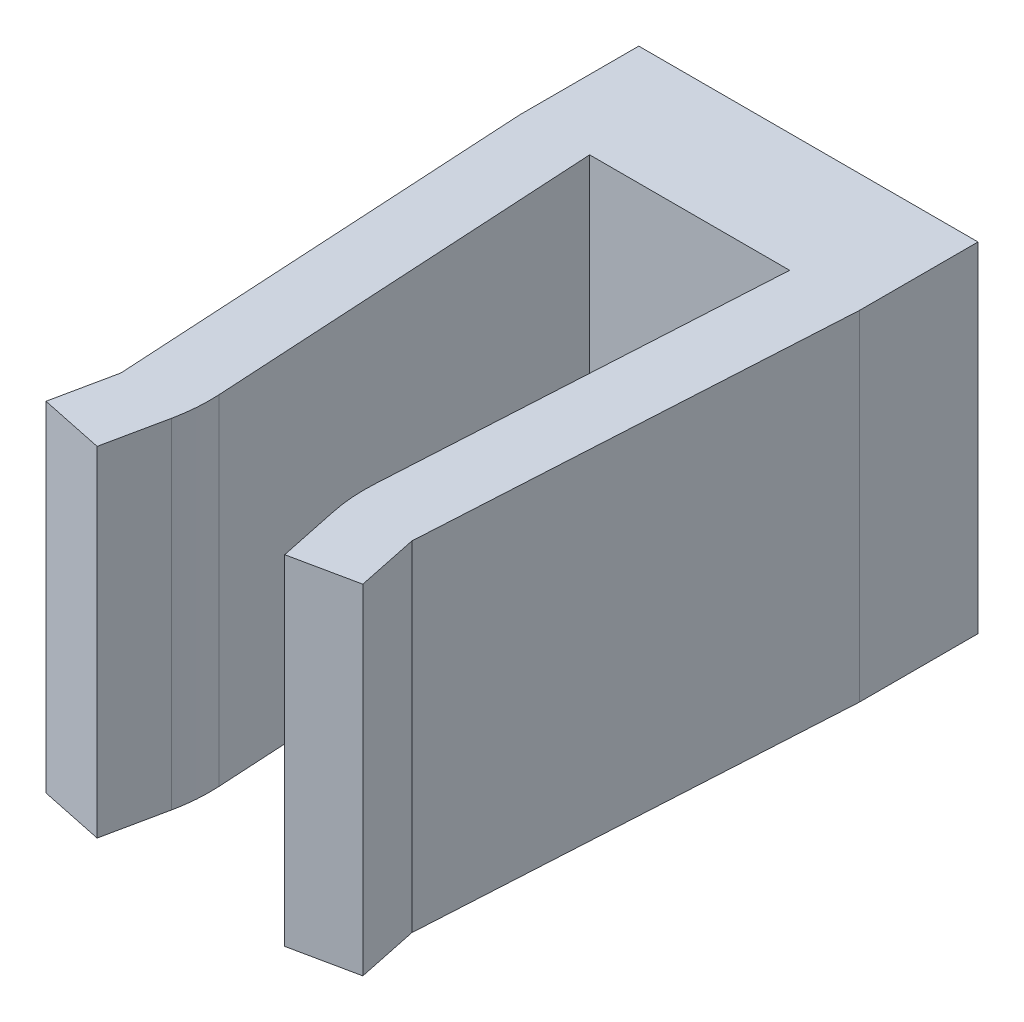
ISO-10303-21;
HEADER;
FILE_DESCRIPTION(('STEP AP214'),'2;1');
FILE_NAME('part.step','',(''),(''),'','','');
FILE_SCHEMA(('AUTOMOTIVE_DESIGN { 1 0 10303 214 1 1 1 1 }'));
ENDSEC;
DATA;
#1=APPLICATION_CONTEXT('core data for automotive mechanical design processes');
#2=APPLICATION_PROTOCOL_DEFINITION('international standard','automotive_design',2000,#1);
#3=PRODUCT_CONTEXT('',#1,'mechanical');
#4=PRODUCT('Part','Part','',(#3));
#5=PRODUCT_RELATED_PRODUCT_CATEGORY('part','',(#4));
#6=PRODUCT_DEFINITION_FORMATION('','',#4);
#7=PRODUCT_DEFINITION_CONTEXT('part definition',#1,'design');
#8=PRODUCT_DEFINITION('design','',#6,#7);
#9=PRODUCT_DEFINITION_SHAPE('','',#8);
#10=(LENGTH_UNIT() NAMED_UNIT(*) SI_UNIT(.MILLI.,.METRE.));
#11=(NAMED_UNIT(*) PLANE_ANGLE_UNIT() SI_UNIT($,.RADIAN.));
#12=(NAMED_UNIT(*) SI_UNIT($,.STERADIAN.) SOLID_ANGLE_UNIT());
#13=UNCERTAINTY_MEASURE_WITH_UNIT(LENGTH_MEASURE(1.E-05),#10,'distance_accuracy_value','');
#14=(GEOMETRIC_REPRESENTATION_CONTEXT(3) GLOBAL_UNCERTAINTY_ASSIGNED_CONTEXT((#13)) GLOBAL_UNIT_ASSIGNED_CONTEXT((#10,
#11,#12)) REPRESENTATION_CONTEXT('',''));
#15=CARTESIAN_POINT('',(0.,0.,0.));
#16=DIRECTION('',(0.,0.,1.));
#17=DIRECTION('',(1.,0.,0.));
#18=AXIS2_PLACEMENT_3D('',#15,#16,#17);
#19=CARTESIAN_POINT('',(0.,0.,7.));
#20=DIRECTION('',(0.,0.,1.));
#21=DIRECTION('',(1.,0.,0.));
#22=AXIS2_PLACEMENT_3D('',#19,#20,#21);
#23=PLANE('',#22);
#24=DIRECTION('',(0.,1.,0.));
#25=VECTOR('',#24,1.);
#26=CARTESIAN_POINT('',(4.10419195222356,-20.,7.));
#27=LINE('',#26,#25);
#28=CARTESIAN_POINT('',(4.10419195222356,-20.,7.));
#29=VERTEX_POINT('',#28);
#30=CARTESIAN_POINT('',(4.10419195222356,0.,7.));
#31=VERTEX_POINT('',#30);
#32=EDGE_CURVE('E198',#29,#31,#27,.T.);
#33=ORIENTED_EDGE('',*,*,#32,.F.);
#34=DIRECTION('',(1.,0.,0.));
#35=VECTOR('',#34,1.);
#36=CARTESIAN_POINT('',(0.,-20.,7.));
#37=LINE('',#36,#35);
#38=CARTESIAN_POINT('',(15.8958080477764,-20.,7.));
#39=VERTEX_POINT('',#38);
#40=EDGE_CURVE('E248',#29,#39,#37,.T.);
#41=ORIENTED_EDGE('',*,*,#40,.T.);
#42=DIRECTION('',(0.,1.,0.));
#43=VECTOR('',#42,1.);
#44=CARTESIAN_POINT('',(15.8958080477764,-20.,7.));
#45=LINE('',#44,#43);
#46=CARTESIAN_POINT('',(15.8958080477764,0.,7.));
#47=VERTEX_POINT('',#46);
#48=EDGE_CURVE('E211',#39,#47,#45,.T.);
#49=ORIENTED_EDGE('',*,*,#48,.T.);
#50=DIRECTION('',(-1.,0.,0.));
#51=VECTOR('',#50,1.);
#52=CARTESIAN_POINT('',(0.,0.,7.));
#53=LINE('',#52,#51);
#54=EDGE_CURVE('E252',#47,#31,#53,.T.);
#55=ORIENTED_EDGE('',*,*,#54,.T.);
#56=EDGE_LOOP('',(#33,#41,#49,#55));
#57=FACE_BOUND('',#56,.T.);
#58=CARTESIAN_POINT('',(10.,-10.,7.));
#59=DIRECTION('',(0.,0.,1.));
#60=DIRECTION('',(1.,0.,0.));
#61=AXIS2_PLACEMENT_3D('',#58,#59,#60);
#62=CIRCLE('',#61,2.75);
#63=CARTESIAN_POINT('',(12.75,-10.,7.));
#64=VERTEX_POINT('',#63);
#65=EDGE_CURVE('E200',#64,#64,#62,.T.);
#66=ORIENTED_EDGE('',*,*,#65,.F.);
#67=EDGE_LOOP('',(#66));
#68=FACE_BOUND('',#67,.T.);
#69=ADVANCED_FACE('F39',(#57,#68),#23,.T.);
#70=CARTESIAN_POINT('',(0.,0.,7.));
#71=DIRECTION('',(1.,0.,0.));
#72=DIRECTION('',(0.,0.,-1.));
#73=AXIS2_PLACEMENT_3D('',#70,#71,#72);
#74=PLANE('',#73);
#75=DIRECTION('',(0.,-1.,0.));
#76=VECTOR('',#75,1.);
#77=CARTESIAN_POINT('',(0.,0.,0.));
#78=LINE('',#77,#76);
#79=CARTESIAN_POINT('',(0.,0.,0.));
#80=VERTEX_POINT('',#79);
#81=CARTESIAN_POINT('',(0.,-20.,0.));
#82=VERTEX_POINT('',#81);
#83=EDGE_CURVE('E241',#80,#82,#78,.T.);
#84=ORIENTED_EDGE('',*,*,#83,.T.);
#85=DIRECTION('',(0.,0.,-1.));
#86=VECTOR('',#85,1.);
#87=CARTESIAN_POINT('',(0.,-20.,7.));
#88=LINE('',#87,#86);
#89=CARTESIAN_POINT('',(0.,-20.,7.));
#90=VERTEX_POINT('',#89);
#91=EDGE_CURVE('E271',#90,#82,#88,.T.);
#92=ORIENTED_EDGE('',*,*,#91,.F.);
#93=DIRECTION('',(0.,-1.,0.));
#94=VECTOR('',#93,1.);
#95=CARTESIAN_POINT('',(0.,0.,7.));
#96=LINE('',#95,#94);
#97=CARTESIAN_POINT('',(0.,0.,7.));
#98=VERTEX_POINT('',#97);
#99=EDGE_CURVE('E179',#98,#90,#96,.T.);
#100=ORIENTED_EDGE('',*,*,#99,.F.);
#101=DIRECTION('',(0.,0.,-1.));
#102=VECTOR('',#101,1.);
#103=CARTESIAN_POINT('',(0.,0.,7.));
#104=LINE('',#103,#102);
#105=EDGE_CURVE('E254',#98,#80,#104,.T.);
#106=ORIENTED_EDGE('',*,*,#105,.T.);
#107=EDGE_LOOP('',(#84,#92,#100,#106));
#108=FACE_BOUND('',#107,.T.);
#109=ADVANCED_FACE('F308',(#108),#74,.F.);
#110=CARTESIAN_POINT('',(0.,-20.,7.));
#111=DIRECTION('',(0.,1.,0.));
#112=DIRECTION('',(0.,0.,1.));
#113=AXIS2_PLACEMENT_3D('',#110,#111,#112);
#114=PLANE('',#113);
#115=DIRECTION('',(0.204768362329063,0.,0.978810460604643));
#116=VECTOR('',#115,1.);
#117=CARTESIAN_POINT('',(15.5298480798096,-20.,36.4041027008711));
#118=LINE('',#117,#116);
#119=CARTESIAN_POINT('',(14.7710214172936,-20.,32.7768457037051));
#120=VERTEX_POINT('',#119);
#121=CARTESIAN_POINT('',(15.5298480798096,-20.,36.4041027008711));
#122=VERTEX_POINT('',#121);
#123=EDGE_CURVE('E231',#120,#122,#118,.T.);
#124=ORIENTED_EDGE('',*,*,#123,.F.);
#125=CARTESIAN_POINT('',(24.5591260233401,-20.,30.7291620804145));
#126=DIRECTION('',(0.,1.,0.));
#127=DIRECTION('',(0.,0.,1.));
#128=AXIS2_PLACEMENT_3D('',#125,#126,#127);
#129=CIRCLE('',#128,10.);
#130=CARTESIAN_POINT('',(14.575340158007,-20.,30.1599347135606));
#131=VERTEX_POINT('',#130);
#132=EDGE_CURVE('E285',#120,#131,#129,.F.);
#133=ORIENTED_EDGE('',*,*,#132,.T.);
#134=DIRECTION('',(-0.0569227366853813,0.,0.998378586533308));
#135=VECTOR('',#134,1.);
#136=CARTESIAN_POINT('',(14.5,-20.,31.4813399171783));
#137=LINE('',#136,#135);
#138=EDGE_CURVE('E217',#39,#131,#137,.T.);
#139=ORIENTED_EDGE('',*,*,#138,.F.);
#140=ORIENTED_EDGE('',*,*,#40,.F.);
#141=DIRECTION('',(-0.0569227366853814,0.,-0.998378586533308));
#142=VECTOR('',#141,1.);
#143=CARTESIAN_POINT('',(5.5,-20.,31.4813399171783));
#144=LINE('',#143,#142);
#145=CARTESIAN_POINT('',(5.42465984199301,-20.,30.1599347135606));
#146=VERTEX_POINT('',#145);
#147=EDGE_CURVE('E162',#146,#29,#144,.T.);
#148=ORIENTED_EDGE('',*,*,#147,.F.);
#149=CARTESIAN_POINT('',(-4.55912602334008,-20.,30.7291620804145));
#150=DIRECTION('',(0.,1.,0.));
#151=DIRECTION('',(0.,0.,1.));
#152=AXIS2_PLACEMENT_3D('',#149,#150,#151);
#153=CIRCLE('',#152,10.);
#154=CARTESIAN_POINT('',(5.22897858270635,-20.,32.7768457037051));
#155=VERTEX_POINT('',#154);
#156=EDGE_CURVE('E53',#146,#155,#153,.F.);
#157=ORIENTED_EDGE('',*,*,#156,.T.);
#158=DIRECTION('',(0.204768362329064,0.,-0.978810460604643));
#159=VECTOR('',#158,1.);
#160=CARTESIAN_POINT('',(4.47015192019041,-20.,36.4041027008711));
#161=LINE('',#160,#159);
#162=CARTESIAN_POINT('',(4.47015192019041,-20.,36.4041027008711));
#163=VERTEX_POINT('',#162);
#164=EDGE_CURVE('E184',#163,#155,#161,.T.);
#165=ORIENTED_EDGE('',*,*,#164,.F.);
#166=DIRECTION('',(0.978810460604643,0.,0.204768362329065));
#167=VECTOR('',#166,1.);
#168=CARTESIAN_POINT('',(0.659996676954795,-20.,35.6070134984376));
#169=LINE('',#168,#167);
#170=CARTESIAN_POINT('',(0.659996676954795,-20.,35.6070134984376));
#171=VERTEX_POINT('',#170);
#172=EDGE_CURVE('E171',#171,#163,#169,.T.);
#173=ORIENTED_EDGE('',*,*,#172,.F.);
#174=DIRECTION('',(-0.204768362329064,0.,0.978810460604643));
#175=VECTOR('',#174,1.);
#176=CARTESIAN_POINT('',(1.42306841713454,-20.,31.9594646633327));
#177=LINE('',#176,#175);
#178=CARTESIAN_POINT('',(1.42306841713454,-20.,31.9594646633327));
#179=VERTEX_POINT('',#178);
#180=EDGE_CURVE('E154',#179,#171,#177,.T.);
#181=ORIENTED_EDGE('',*,*,#180,.F.);
#182=DIRECTION('',(0.0569227366853815,0.,0.998378586533308));
#183=VECTOR('',#182,1.);
#184=CARTESIAN_POINT('',(0.,-20.,7.));
#185=LINE('',#184,#183);
#186=EDGE_CURVE('E168',#90,#179,#185,.T.);
#187=ORIENTED_EDGE('',*,*,#186,.F.);
#188=ORIENTED_EDGE('',*,*,#91,.T.);
#189=DIRECTION('',(1.,0.,0.));
#190=VECTOR('',#189,1.);
#191=CARTESIAN_POINT('',(0.,-20.,0.));
#192=LINE('',#191,#190);
#193=CARTESIAN_POINT('',(20.,-20.,0.));
#194=VERTEX_POINT('',#193);
#195=EDGE_CURVE('E256',#82,#194,#192,.T.);
#196=ORIENTED_EDGE('',*,*,#195,.T.);
#197=DIRECTION('',(0.,0.,-1.));
#198=VECTOR('',#197,1.);
#199=CARTESIAN_POINT('',(20.,-20.,7.));
#200=LINE('',#199,#198);
#201=CARTESIAN_POINT('',(20.,-20.,7.));
#202=VERTEX_POINT('',#201);
#203=EDGE_CURVE('E268',#202,#194,#200,.T.);
#204=ORIENTED_EDGE('',*,*,#203,.F.);
#205=DIRECTION('',(0.0569227366853815,0.,-0.998378586533308));
#206=VECTOR('',#205,1.);
#207=CARTESIAN_POINT('',(20.,-20.,7.));
#208=LINE('',#207,#206);
#209=CARTESIAN_POINT('',(18.5769315828655,-20.,31.9594646633327));
#210=VERTEX_POINT('',#209);
#211=EDGE_CURVE('E206',#210,#202,#208,.T.);
#212=ORIENTED_EDGE('',*,*,#211,.F.);
#213=DIRECTION('',(-0.204768362329066,0.,-0.978810460604642));
#214=VECTOR('',#213,1.);
#215=CARTESIAN_POINT('',(18.5769315828655,-20.,31.9594646633327));
#216=LINE('',#215,#214);
#217=CARTESIAN_POINT('',(19.3400033230452,-20.,35.6070134984376));
#218=VERTEX_POINT('',#217);
#219=EDGE_CURVE('E228',#218,#210,#216,.T.);
#220=ORIENTED_EDGE('',*,*,#219,.F.);
#221=DIRECTION('',(0.978810460604643,0.,-0.204768362329064));
#222=VECTOR('',#221,1.);
#223=CARTESIAN_POINT('',(19.3400033230452,-20.,35.6070134984376));
#224=LINE('',#223,#222);
#225=EDGE_CURVE('E234',#122,#218,#224,.T.);
#226=ORIENTED_EDGE('',*,*,#225,.F.);
#227=EDGE_LOOP('',(#124,#133,#139,#140,#148,#157,#165,#173,#181,#187,#188,#196,#204,#212,#220,#226));
#228=FACE_BOUND('',#227,.T.);
#229=ADVANCED_FACE('F169',(#228),#114,.F.);
#230=CARTESIAN_POINT('',(20.,0.,7.));
#231=DIRECTION('',(-1.,0.,0.));
#232=DIRECTION('',(0.,-1.,0.));
#233=AXIS2_PLACEMENT_3D('',#230,#231,#232);
#234=PLANE('',#233);
#235=DIRECTION('',(0.,1.,0.));
#236=VECTOR('',#235,1.);
#237=CARTESIAN_POINT('',(20.,0.,0.));
#238=LINE('',#237,#236);
#239=CARTESIAN_POINT('',(20.,0.,0.));
#240=VERTEX_POINT('',#239);
#241=EDGE_CURVE('E257',#194,#240,#238,.T.);
#242=ORIENTED_EDGE('',*,*,#241,.T.);
#243=DIRECTION('',(0.,0.,-1.));
#244=VECTOR('',#243,1.);
#245=CARTESIAN_POINT('',(20.,0.,7.));
#246=LINE('',#245,#244);
#247=CARTESIAN_POINT('',(20.,0.,7.));
#248=VERTEX_POINT('',#247);
#249=EDGE_CURVE('E264',#248,#240,#246,.T.);
#250=ORIENTED_EDGE('',*,*,#249,.F.);
#251=DIRECTION('',(0.,1.,0.));
#252=VECTOR('',#251,1.);
#253=CARTESIAN_POINT('',(20.,0.,7.));
#254=LINE('',#253,#252);
#255=EDGE_CURVE('E246',#202,#248,#254,.T.);
#256=ORIENTED_EDGE('',*,*,#255,.F.);
#257=ORIENTED_EDGE('',*,*,#203,.T.);
#258=EDGE_LOOP('',(#242,#250,#256,#257));
#259=FACE_BOUND('',#258,.T.);
#260=ADVANCED_FACE('F330',(#259),#234,.F.);
#261=CARTESIAN_POINT('',(0.,0.,7.));
#262=DIRECTION('',(0.,-1.,0.));
#263=DIRECTION('',(0.,0.,-1.));
#264=AXIS2_PLACEMENT_3D('',#261,#262,#263);
#265=PLANE('',#264);
#266=DIRECTION('',(-0.0569227366853813,0.,0.998378586533308));
#267=VECTOR('',#266,1.);
#268=CARTESIAN_POINT('',(14.5,0.,31.4813399171783));
#269=LINE('',#268,#267);
#270=CARTESIAN_POINT('',(14.575340158007,0.,30.1599347135606));
#271=VERTEX_POINT('',#270);
#272=EDGE_CURVE('E188',#47,#271,#269,.T.);
#273=ORIENTED_EDGE('',*,*,#272,.T.);
#274=CARTESIAN_POINT('',(24.5591260233401,0.,30.7291620804145));
#275=DIRECTION('',(0.,-1.,0.));
#276=DIRECTION('',(0.,0.,-1.));
#277=AXIS2_PLACEMENT_3D('',#274,#275,#276);
#278=CIRCLE('',#277,10.);
#279=CARTESIAN_POINT('',(14.7710214172936,0.,32.7768457037051));
#280=VERTEX_POINT('',#279);
#281=EDGE_CURVE('E279',#271,#280,#278,.F.);
#282=ORIENTED_EDGE('',*,*,#281,.T.);
#283=DIRECTION('',(0.204768362329063,0.,0.978810460604643));
#284=VECTOR('',#283,1.);
#285=CARTESIAN_POINT('',(15.5298480798096,0.,36.4041027008711));
#286=LINE('',#285,#284);
#287=CARTESIAN_POINT('',(15.5298480798096,0.,36.4041027008711));
#288=VERTEX_POINT('',#287);
#289=EDGE_CURVE('E221',#280,#288,#286,.T.);
#290=ORIENTED_EDGE('',*,*,#289,.T.);
#291=DIRECTION('',(0.978810460604643,0.,-0.204768362329064));
#292=VECTOR('',#291,1.);
#293=CARTESIAN_POINT('',(19.3400033230452,0.,35.6070134984376));
#294=LINE('',#293,#292);
#295=CARTESIAN_POINT('',(19.3400033230452,0.,35.6070134984376));
#296=VERTEX_POINT('',#295);
#297=EDGE_CURVE('E222',#288,#296,#294,.T.);
#298=ORIENTED_EDGE('',*,*,#297,.T.);
#299=DIRECTION('',(-0.204768362329066,0.,-0.978810460604642));
#300=VECTOR('',#299,1.);
#301=CARTESIAN_POINT('',(18.5769315828655,0.,31.9594646633327));
#302=LINE('',#301,#300);
#303=CARTESIAN_POINT('',(18.5769315828655,0.,31.9594646633327));
#304=VERTEX_POINT('',#303);
#305=EDGE_CURVE('E220',#296,#304,#302,.T.);
#306=ORIENTED_EDGE('',*,*,#305,.T.);
#307=DIRECTION('',(0.0569227366853815,0.,-0.998378586533308));
#308=VECTOR('',#307,1.);
#309=CARTESIAN_POINT('',(20.,0.,7.));
#310=LINE('',#309,#308);
#311=EDGE_CURVE('E212',#304,#248,#310,.T.);
#312=ORIENTED_EDGE('',*,*,#311,.T.);
#313=ORIENTED_EDGE('',*,*,#249,.T.);
#314=DIRECTION('',(-1.,0.,0.));
#315=VECTOR('',#314,1.);
#316=CARTESIAN_POINT('',(0.,0.,0.));
#317=LINE('',#316,#315);
#318=EDGE_CURVE('E249',#240,#80,#317,.T.);
#319=ORIENTED_EDGE('',*,*,#318,.T.);
#320=ORIENTED_EDGE('',*,*,#105,.F.);
#321=DIRECTION('',(0.0569227366853815,0.,0.998378586533308));
#322=VECTOR('',#321,1.);
#323=CARTESIAN_POINT('',(0.,0.,7.));
#324=LINE('',#323,#322);
#325=CARTESIAN_POINT('',(1.42306841713454,0.,31.9594646633327));
#326=VERTEX_POINT('',#325);
#327=EDGE_CURVE('E186',#98,#326,#324,.T.);
#328=ORIENTED_EDGE('',*,*,#327,.T.);
#329=DIRECTION('',(-0.204768362329064,0.,0.978810460604643));
#330=VECTOR('',#329,1.);
#331=CARTESIAN_POINT('',(1.42306841713454,0.,31.9594646633327));
#332=LINE('',#331,#330);
#333=CARTESIAN_POINT('',(0.659996676954795,0.,35.6070134984376));
#334=VERTEX_POINT('',#333);
#335=EDGE_CURVE('E160',#326,#334,#332,.T.);
#336=ORIENTED_EDGE('',*,*,#335,.T.);
#337=DIRECTION('',(0.978810460604643,0.,0.204768362329065));
#338=VECTOR('',#337,1.);
#339=CARTESIAN_POINT('',(0.659996676954795,0.,35.6070134984376));
#340=LINE('',#339,#338);
#341=CARTESIAN_POINT('',(4.47015192019041,0.,36.4041027008711));
#342=VERTEX_POINT('',#341);
#343=EDGE_CURVE('E193',#334,#342,#340,.T.);
#344=ORIENTED_EDGE('',*,*,#343,.T.);
#345=DIRECTION('',(0.204768362329064,0.,-0.978810460604643));
#346=VECTOR('',#345,1.);
#347=CARTESIAN_POINT('',(4.47015192019041,0.,36.4041027008711));
#348=LINE('',#347,#346);
#349=CARTESIAN_POINT('',(5.22897858270635,0.,32.7768457037051));
#350=VERTEX_POINT('',#349);
#351=EDGE_CURVE('E176',#342,#350,#348,.T.);
#352=ORIENTED_EDGE('',*,*,#351,.T.);
#353=CARTESIAN_POINT('',(-4.55912602334008,0.,30.7291620804145));
#354=DIRECTION('',(0.,-1.,0.));
#355=DIRECTION('',(0.,0.,-1.));
#356=AXIS2_PLACEMENT_3D('',#353,#354,#355);
#357=CIRCLE('',#356,10.);
#358=CARTESIAN_POINT('',(5.42465984199301,0.,30.1599347135606));
#359=VERTEX_POINT('',#358);
#360=EDGE_CURVE('E277',#350,#359,#357,.F.);
#361=ORIENTED_EDGE('',*,*,#360,.T.);
#362=DIRECTION('',(-0.0569227366853814,0.,-0.998378586533308));
#363=VECTOR('',#362,1.);
#364=CARTESIAN_POINT('',(5.5,0.,31.4813399171783));
#365=LINE('',#364,#363);
#366=EDGE_CURVE('E177',#359,#31,#365,.T.);
#367=ORIENTED_EDGE('',*,*,#366,.T.);
#368=ORIENTED_EDGE('',*,*,#54,.F.);
#369=EDGE_LOOP('',(#273,#282,#290,#298,#306,#312,#313,#319,#320,#328,#336,#344,#352,#361,#367,#368));
#370=FACE_BOUND('',#369,.T.);
#371=ADVANCED_FACE('F292',(#370),#265,.F.);
#372=CARTESIAN_POINT('',(0.,0.,0.));
#373=DIRECTION('',(0.,0.,1.));
#374=DIRECTION('',(1.,0.,0.));
#375=AXIS2_PLACEMENT_3D('',#372,#373,#374);
#376=PLANE('',#375);
#377=CARTESIAN_POINT('',(10.,-10.,0.));
#378=DIRECTION('',(0.,0.,1.));
#379=DIRECTION('',(1.,0.,0.));
#380=AXIS2_PLACEMENT_3D('',#377,#378,#379);
#381=CIRCLE('',#380,2.75);
#382=CARTESIAN_POINT('',(12.75,-10.,0.));
#383=VERTEX_POINT('',#382);
#384=EDGE_CURVE('E239',#383,#383,#381,.T.);
#385=ORIENTED_EDGE('',*,*,#384,.T.);
#386=EDGE_LOOP('',(#385));
#387=FACE_BOUND('',#386,.T.);
#388=ORIENTED_EDGE('',*,*,#83,.F.);
#389=ORIENTED_EDGE('',*,*,#318,.F.);
#390=ORIENTED_EDGE('',*,*,#241,.F.);
#391=ORIENTED_EDGE('',*,*,#195,.F.);
#392=EDGE_LOOP('',(#388,#389,#390,#391));
#393=FACE_BOUND('',#392,.T.);
#394=ADVANCED_FACE('F321',(#387,#393),#376,.F.);
#395=CARTESIAN_POINT('',(10.,-10.,0.));
#396=DIRECTION('',(0.,0.,1.));
#397=DIRECTION('',(1.,0.,0.));
#398=AXIS2_PLACEMENT_3D('',#395,#396,#397);
#399=CYLINDRICAL_SURFACE('',#398,2.75);
#400=ORIENTED_EDGE('',*,*,#384,.F.);
#401=EDGE_LOOP('',(#400));
#402=FACE_BOUND('',#401,.T.);
#403=ORIENTED_EDGE('',*,*,#65,.T.);
#404=EDGE_LOOP('',(#403));
#405=FACE_BOUND('',#404,.T.);
#406=ADVANCED_FACE('F317',(#402,#405),#399,.F.);
#407=CARTESIAN_POINT('',(14.5,-20.,31.4813399171783));
#408=DIRECTION('',(-0.998378586533308,0.,-0.0569227366853813));
#409=DIRECTION('',(-0.0569227366853813,0.,0.998378586533308));
#410=AXIS2_PLACEMENT_3D('',#407,#408,#409);
#411=PLANE('',#410);
#412=ORIENTED_EDGE('',*,*,#138,.T.);
#413=DIRECTION('',(0.,1.,0.));
#414=VECTOR('',#413,1.);
#415=CARTESIAN_POINT('',(14.575340158007,-20.,30.1599347135606));
#416=LINE('',#415,#414);
#417=EDGE_CURVE('E272',#131,#271,#416,.T.);
#418=ORIENTED_EDGE('',*,*,#417,.T.);
#419=ORIENTED_EDGE('',*,*,#272,.F.);
#420=ORIENTED_EDGE('',*,*,#48,.F.);
#421=EDGE_LOOP('',(#412,#418,#419,#420));
#422=FACE_BOUND('',#421,.T.);
#423=ADVANCED_FACE('F350',(#422),#411,.T.);
#424=CARTESIAN_POINT('',(20.,-20.,7.));
#425=DIRECTION('',(0.998378586533308,0.,0.0569227366853815));
#426=DIRECTION('',(0.0569227366853815,0.,-0.998378586533309));
#427=AXIS2_PLACEMENT_3D('',#424,#425,#426);
#428=PLANE('',#427);
#429=ORIENTED_EDGE('',*,*,#311,.F.);
#430=DIRECTION('',(0.,1.,0.));
#431=VECTOR('',#430,1.);
#432=CARTESIAN_POINT('',(18.5769315828655,-20.,31.9594646633327));
#433=LINE('',#432,#431);
#434=EDGE_CURVE('E207',#210,#304,#433,.T.);
#435=ORIENTED_EDGE('',*,*,#434,.F.);
#436=ORIENTED_EDGE('',*,*,#211,.T.);
#437=ORIENTED_EDGE('',*,*,#255,.T.);
#438=EDGE_LOOP('',(#429,#435,#436,#437));
#439=FACE_BOUND('',#438,.T.);
#440=ADVANCED_FACE('F366',(#439),#428,.T.);
#441=CARTESIAN_POINT('',(18.5769315828655,-20.,31.9594646633327));
#442=DIRECTION('',(0.978810460604642,0.,-0.204768362329066));
#443=DIRECTION('',(-0.204768362329066,0.,-0.978810460604642));
#444=AXIS2_PLACEMENT_3D('',#441,#442,#443);
#445=PLANE('',#444);
#446=ORIENTED_EDGE('',*,*,#305,.F.);
#447=DIRECTION('',(0.,1.,0.));
#448=VECTOR('',#447,1.);
#449=CARTESIAN_POINT('',(19.3400033230452,-20.,35.6070134984376));
#450=LINE('',#449,#448);
#451=EDGE_CURVE('E210',#218,#296,#450,.T.);
#452=ORIENTED_EDGE('',*,*,#451,.F.);
#453=ORIENTED_EDGE('',*,*,#219,.T.);
#454=ORIENTED_EDGE('',*,*,#434,.T.);
#455=EDGE_LOOP('',(#446,#452,#453,#454));
#456=FACE_BOUND('',#455,.T.);
#457=ADVANCED_FACE('F363',(#456),#445,.T.);
#458=CARTESIAN_POINT('',(19.3400033230452,-20.,35.6070134984376));
#459=DIRECTION('',(0.204768362329064,0.,0.978810460604643));
#460=DIRECTION('',(0.978810460604643,0.,-0.204768362329064));
#461=AXIS2_PLACEMENT_3D('',#458,#459,#460);
#462=PLANE('',#461);
#463=ORIENTED_EDGE('',*,*,#297,.F.);
#464=DIRECTION('',(0.,1.,0.));
#465=VECTOR('',#464,1.);
#466=CARTESIAN_POINT('',(15.5298480798096,-20.,36.4041027008711));
#467=LINE('',#466,#465);
#468=EDGE_CURVE('E201',#122,#288,#467,.T.);
#469=ORIENTED_EDGE('',*,*,#468,.F.);
#470=ORIENTED_EDGE('',*,*,#225,.T.);
#471=ORIENTED_EDGE('',*,*,#451,.T.);
#472=EDGE_LOOP('',(#463,#469,#470,#471));
#473=FACE_BOUND('',#472,.T.);
#474=ADVANCED_FACE('F352',(#473),#462,.T.);
#475=CARTESIAN_POINT('',(15.5298480798096,-20.,36.4041027008711));
#476=DIRECTION('',(-0.978810460604643,0.,0.204768362329063));
#477=DIRECTION('',(0.204768362329063,0.,0.978810460604643));
#478=AXIS2_PLACEMENT_3D('',#475,#476,#477);
#479=PLANE('',#478);
#480=ORIENTED_EDGE('',*,*,#289,.F.);
#481=DIRECTION('',(0.,1.,0.));
#482=VECTOR('',#481,1.);
#483=CARTESIAN_POINT('',(14.7710214172936,-20.,32.7768457037051));
#484=LINE('',#483,#482);
#485=EDGE_CURVE('E278',#280,#120,#484,.F.);
#486=ORIENTED_EDGE('',*,*,#485,.T.);
#487=ORIENTED_EDGE('',*,*,#123,.T.);
#488=ORIENTED_EDGE('',*,*,#468,.T.);
#489=EDGE_LOOP('',(#480,#486,#487,#488));
#490=FACE_BOUND('',#489,.T.);
#491=ADVANCED_FACE('F348',(#490),#479,.T.);
#492=CARTESIAN_POINT('',(5.5,-20.,31.4813399171783));
#493=DIRECTION('',(0.998378586533308,0.,-0.0569227366853814));
#494=DIRECTION('',(-0.0569227366853814,0.,-0.998378586533308));
#495=AXIS2_PLACEMENT_3D('',#492,#493,#494);
#496=PLANE('',#495);
#497=ORIENTED_EDGE('',*,*,#366,.F.);
#498=DIRECTION('',(0.,1.,0.));
#499=VECTOR('',#498,1.);
#500=CARTESIAN_POINT('',(5.42465984199301,-20.,30.1599347135606));
#501=LINE('',#500,#499);
#502=EDGE_CURVE('E11',#359,#146,#501,.F.);
#503=ORIENTED_EDGE('',*,*,#502,.T.);
#504=ORIENTED_EDGE('',*,*,#147,.T.);
#505=ORIENTED_EDGE('',*,*,#32,.T.);
#506=EDGE_LOOP('',(#497,#503,#504,#505));
#507=FACE_BOUND('',#506,.T.);
#508=ADVANCED_FACE('F302',(#507),#496,.T.);
#509=CARTESIAN_POINT('',(4.47015192019041,-20.,36.4041027008711));
#510=DIRECTION('',(0.978810460604643,0.,0.204768362329064));
#511=DIRECTION('',(0.204768362329064,0.,-0.978810460604643));
#512=AXIS2_PLACEMENT_3D('',#509,#510,#511);
#513=PLANE('',#512);
#514=ORIENTED_EDGE('',*,*,#164,.T.);
#515=DIRECTION('',(0.,1.,0.));
#516=VECTOR('',#515,1.);
#517=CARTESIAN_POINT('',(5.22897858270635,-20.,32.7768457037051));
#518=LINE('',#517,#516);
#519=EDGE_CURVE('E50',#155,#350,#518,.T.);
#520=ORIENTED_EDGE('',*,*,#519,.T.);
#521=ORIENTED_EDGE('',*,*,#351,.F.);
#522=DIRECTION('',(0.,1.,0.));
#523=VECTOR('',#522,1.);
#524=CARTESIAN_POINT('',(4.47015192019041,-20.,36.4041027008711));
#525=LINE('',#524,#523);
#526=EDGE_CURVE('E199',#163,#342,#525,.T.);
#527=ORIENTED_EDGE('',*,*,#526,.F.);
#528=EDGE_LOOP('',(#514,#520,#521,#527));
#529=FACE_BOUND('',#528,.T.);
#530=ADVANCED_FACE('F287',(#529),#513,.T.);
#531=CARTESIAN_POINT('',(0.659996676954795,-20.,35.6070134984376));
#532=DIRECTION('',(-0.204768362329065,0.,0.978810460604643));
#533=DIRECTION('',(0.978810460604643,0.,0.204768362329065));
#534=AXIS2_PLACEMENT_3D('',#531,#532,#533);
#535=PLANE('',#534);
#536=ORIENTED_EDGE('',*,*,#343,.F.);
#537=DIRECTION('',(0.,1.,0.));
#538=VECTOR('',#537,1.);
#539=CARTESIAN_POINT('',(0.659996676954795,-20.,35.6070134984376));
#540=LINE('',#539,#538);
#541=EDGE_CURVE('E165',#171,#334,#540,.T.);
#542=ORIENTED_EDGE('',*,*,#541,.F.);
#543=ORIENTED_EDGE('',*,*,#172,.T.);
#544=ORIENTED_EDGE('',*,*,#526,.T.);
#545=EDGE_LOOP('',(#536,#542,#543,#544));
#546=FACE_BOUND('',#545,.T.);
#547=ADVANCED_FACE('F294',(#546),#535,.T.);
#548=CARTESIAN_POINT('',(1.42306841713454,-20.,31.9594646633327));
#549=DIRECTION('',(-0.978810460604643,0.,-0.204768362329064));
#550=DIRECTION('',(-0.204768362329064,0.,0.978810460604643));
#551=AXIS2_PLACEMENT_3D('',#548,#549,#550);
#552=PLANE('',#551);
#553=ORIENTED_EDGE('',*,*,#335,.F.);
#554=DIRECTION('',(0.,1.,0.));
#555=VECTOR('',#554,1.);
#556=CARTESIAN_POINT('',(1.42306841713454,-20.,31.9594646633327));
#557=LINE('',#556,#555);
#558=EDGE_CURVE('E155',#179,#326,#557,.T.);
#559=ORIENTED_EDGE('',*,*,#558,.F.);
#560=ORIENTED_EDGE('',*,*,#180,.T.);
#561=ORIENTED_EDGE('',*,*,#541,.T.);
#562=EDGE_LOOP('',(#553,#559,#560,#561));
#563=FACE_BOUND('',#562,.T.);
#564=ADVANCED_FACE('F152',(#563),#552,.T.);
#565=CARTESIAN_POINT('',(0.,-20.,7.));
#566=DIRECTION('',(-0.998378586533308,0.,0.0569227366853815));
#567=DIRECTION('',(0.0569227366853815,0.,0.998378586533309));
#568=AXIS2_PLACEMENT_3D('',#565,#566,#567);
#569=PLANE('',#568);
#570=ORIENTED_EDGE('',*,*,#327,.F.);
#571=ORIENTED_EDGE('',*,*,#99,.T.);
#572=ORIENTED_EDGE('',*,*,#186,.T.);
#573=ORIENTED_EDGE('',*,*,#558,.T.);
#574=EDGE_LOOP('',(#570,#571,#572,#573));
#575=FACE_BOUND('',#574,.T.);
#576=ADVANCED_FACE('F172',(#575),#569,.T.);
#577=CARTESIAN_POINT('',(24.5591260233401,-20.,30.7291620804145));
#578=DIRECTION('',(0.,1.,0.));
#579=DIRECTION('',(0.,0.,1.));
#580=AXIS2_PLACEMENT_3D('',#577,#578,#579);
#581=CYLINDRICAL_SURFACE('',#580,10.);
#582=ORIENTED_EDGE('',*,*,#132,.F.);
#583=ORIENTED_EDGE('',*,*,#485,.F.);
#584=ORIENTED_EDGE('',*,*,#281,.F.);
#585=ORIENTED_EDGE('',*,*,#417,.F.);
#586=EDGE_LOOP('',(#582,#583,#584,#585));
#587=FACE_BOUND('',#586,.T.);
#588=ADVANCED_FACE('F335',(#587),#581,.T.);
#589=CARTESIAN_POINT('',(-4.55912602334008,-20.,30.7291620804145));
#590=DIRECTION('',(0.,1.,0.));
#591=DIRECTION('',(0.,0.,1.));
#592=AXIS2_PLACEMENT_3D('',#589,#590,#591);
#593=CYLINDRICAL_SURFACE('',#592,10.);
#594=ORIENTED_EDGE('',*,*,#156,.F.);
#595=ORIENTED_EDGE('',*,*,#502,.F.);
#596=ORIENTED_EDGE('',*,*,#360,.F.);
#597=ORIENTED_EDGE('',*,*,#519,.F.);
#598=EDGE_LOOP('',(#594,#595,#596,#597));
#599=FACE_BOUND('',#598,.T.);
#600=ADVANCED_FACE('F41',(#599),#593,.T.);
#601=CLOSED_SHELL('',(#69,#109,#229,#260,#371,#394,#406,#423,#440,#457,#474,#491,#508,#530,#547,
#564,#576,#588,#600));
#602=MANIFOLD_SOLID_BREP('B2',#601);
#603=ADVANCED_BREP_SHAPE_REPRESENTATION('',(#18,#602),#14);
#604=SHAPE_DEFINITION_REPRESENTATION(#9,#603);
ENDSEC;
END-ISO-10303-21;
